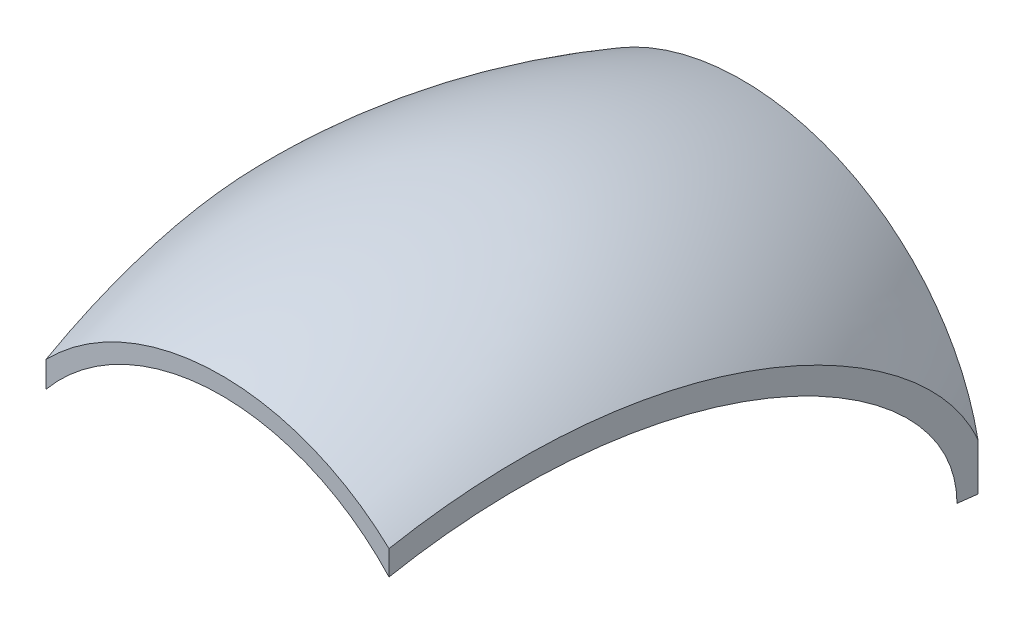
ISO-10303-21;
HEADER;
FILE_DESCRIPTION(('STEP AP214'),'2;1');
FILE_NAME('part.step','',(''),(''),'','','');
FILE_SCHEMA(('AUTOMOTIVE_DESIGN { 1 0 10303 214 1 1 1 1 }'));
ENDSEC;
DATA;
#1=APPLICATION_CONTEXT('core data for automotive mechanical design processes');
#2=APPLICATION_PROTOCOL_DEFINITION('international standard','automotive_design',2000,#1);
#3=PRODUCT_CONTEXT('',#1,'mechanical');
#4=PRODUCT('Part','Part','',(#3));
#5=PRODUCT_RELATED_PRODUCT_CATEGORY('part','',(#4));
#6=PRODUCT_DEFINITION_FORMATION('','',#4);
#7=PRODUCT_DEFINITION_CONTEXT('part definition',#1,'design');
#8=PRODUCT_DEFINITION('design','',#6,#7);
#9=PRODUCT_DEFINITION_SHAPE('','',#8);
#10=(LENGTH_UNIT() NAMED_UNIT(*) SI_UNIT(.MILLI.,.METRE.));
#11=(NAMED_UNIT(*) PLANE_ANGLE_UNIT() SI_UNIT($,.RADIAN.));
#12=(NAMED_UNIT(*) SI_UNIT($,.STERADIAN.) SOLID_ANGLE_UNIT());
#13=UNCERTAINTY_MEASURE_WITH_UNIT(LENGTH_MEASURE(1.E-05),#10,'distance_accuracy_value','');
#14=(GEOMETRIC_REPRESENTATION_CONTEXT(3) GLOBAL_UNCERTAINTY_ASSIGNED_CONTEXT((#13)) GLOBAL_UNIT_ASSIGNED_CONTEXT((#10,
#11,#12)) REPRESENTATION_CONTEXT('',''));
#15=CARTESIAN_POINT('',(0.,0.,0.));
#16=DIRECTION('',(0.,0.,1.));
#17=DIRECTION('',(1.,0.,0.));
#18=AXIS2_PLACEMENT_3D('',#15,#16,#17);
#19=CARTESIAN_POINT('',(0.,0.,120.));
#20=DIRECTION('',(0.,0.,1.));
#21=DIRECTION('',(1.,0.,0.));
#22=AXIS2_PLACEMENT_3D('',#19,#20,#21);
#23=PLANE('',#22);
#24=CARTESIAN_POINT('',(0.,0.,120.));
#25=DIRECTION('',(0.,0.,1.));
#26=DIRECTION('',(1.,0.,0.));
#27=AXIS2_PLACEMENT_3D('',#24,#25,#26);
#28=CIRCLE('',#27,52.5);
#29=CARTESIAN_POINT('',(38.6400456419407,35.5415137947988,120.));
#30=VERTEX_POINT('',#29);
#31=CARTESIAN_POINT('',(-40.449298230202,33.4678890074766,120.));
#32=VERTEX_POINT('',#31);
#33=EDGE_CURVE('E348',#30,#32,#28,.T.);
#34=ORIENTED_EDGE('',*,*,#33,.F.);
#35=DIRECTION('',(0.,1.,0.));
#36=VECTOR('',#35,1.);
#37=CARTESIAN_POINT('',(38.6400456420249,0.,120.));
#38=LINE('',#37,#36);
#39=CARTESIAN_POINT('',(38.6400456420249,41.2213647106911,120.));
#40=VERTEX_POINT('',#39);
#41=EDGE_CURVE('E162',#30,#40,#38,.T.);
#42=ORIENTED_EDGE('',*,*,#41,.T.);
#43=CARTESIAN_POINT('',(0.,0.,120.));
#44=DIRECTION('',(0.,0.,1.));
#45=DIRECTION('',(1.,0.,0.));
#46=AXIS2_PLACEMENT_3D('',#43,#44,#45);
#47=CIRCLE('',#46,56.5);
#48=CARTESIAN_POINT('',(-40.4492982309235,39.4475696083579,120.));
#49=VERTEX_POINT('',#48);
#50=EDGE_CURVE('E147',#40,#49,#47,.T.);
#51=ORIENTED_EDGE('',*,*,#50,.T.);
#52=DIRECTION('',(0.,1.,0.));
#53=VECTOR('',#52,1.);
#54=CARTESIAN_POINT('',(-40.4492982300881,4.84831124224447E-13,120.));
#55=LINE('',#54,#53);
#56=EDGE_CURVE('E297',#32,#49,#55,.T.);
#57=ORIENTED_EDGE('',*,*,#56,.F.);
#58=EDGE_LOOP('',(#34,#42,#51,#57));
#59=FACE_BOUND('',#58,.T.);
#60=ADVANCED_FACE('F143',(#59),#23,.T.);
#61=CARTESIAN_POINT('',(0.,0.,0.));
#62=DIRECTION('',(0.,0.,1.));
#63=DIRECTION('',(1.,0.,0.));
#64=AXIS2_PLACEMENT_3D('',#61,#62,#63);
#65=PLANE('',#64);
#66=DIRECTION('',(0.,1.,0.));
#67=VECTOR('',#66,1.);
#68=CARTESIAN_POINT('',(54.4383453525087,0.,0.));
#69=LINE('',#68,#67);
#70=CARTESIAN_POINT('',(54.4383453525087,0.,0.));
#71=VERTEX_POINT('',#70);
#72=CARTESIAN_POINT('',(54.4383453501977,10.8038806309582,0.));
#73=VERTEX_POINT('',#72);
#74=EDGE_CURVE('E213',#71,#73,#69,.T.);
#75=ORIENTED_EDGE('',*,*,#74,.F.);
#76=DIRECTION('',(1.,0.,0.));
#77=VECTOR('',#76,1.);
#78=CARTESIAN_POINT('',(0.,0.,0.));
#79=LINE('',#78,#77);
#80=CARTESIAN_POINT('',(52.5,0.,0.));
#81=VERTEX_POINT('',#80);
#82=EDGE_CURVE('E210',#81,#71,#79,.T.);
#83=ORIENTED_EDGE('',*,*,#82,.F.);
#84=CARTESIAN_POINT('',(0.,0.,0.));
#85=DIRECTION('',(0.,0.,1.));
#86=DIRECTION('',(1.,0.,0.));
#87=AXIS2_PLACEMENT_3D('',#84,#85,#86);
#88=CIRCLE('',#87,52.5);
#89=CARTESIAN_POINT('',(-52.5,0.,0.));
#90=VERTEX_POINT('',#89);
#91=EDGE_CURVE('E217',#81,#90,#88,.T.);
#92=ORIENTED_EDGE('',*,*,#91,.T.);
#93=DIRECTION('',(-1.,0.,0.));
#94=VECTOR('',#93,1.);
#95=CARTESIAN_POINT('',(0.,0.,0.));
#96=LINE('',#95,#94);
#97=CARTESIAN_POINT('',(-55.5,0.,0.));
#98=VERTEX_POINT('',#97);
#99=EDGE_CURVE('E227',#90,#98,#96,.T.);
#100=ORIENTED_EDGE('',*,*,#99,.T.);
#101=CARTESIAN_POINT('',(0.,0.,0.));
#102=DIRECTION('',(0.,0.,1.));
#103=DIRECTION('',(1.,0.,0.));
#104=AXIS2_PLACEMENT_3D('',#101,#102,#103);
#105=CIRCLE('',#104,55.5);
#106=EDGE_CURVE('E337',#73,#98,#105,.T.);
#107=ORIENTED_EDGE('',*,*,#106,.F.);
#108=EDGE_LOOP('',(#75,#83,#92,#100,#107));
#109=FACE_BOUND('',#108,.T.);
#110=ADVANCED_FACE('F263',(#109),#65,.F.);
#111=CARTESIAN_POINT('',(52.5,0.,0.));
#112=DIRECTION('',(0.,-1.,0.));
#113=DIRECTION('',(1.,0.,0.));
#114=AXIS2_PLACEMENT_3D('',#111,#112,#113);
#115=PLANE('',#114);
#116=ORIENTED_EDGE('',*,*,#82,.T.);
#117=DIRECTION('',(-0.130526192220021,0.,0.991444861373815));
#118=VECTOR('',#117,1.);
#119=CARTESIAN_POINT('',(54.4053215943821,0.,0.250840346607543));
#120=LINE('',#119,#118);
#121=CARTESIAN_POINT('',(53.8751724265603,0.,4.27772303350647));
#122=VERTEX_POINT('',#121);
#123=EDGE_CURVE('E199',#71,#122,#120,.T.);
#124=ORIENTED_EDGE('',*,*,#123,.T.);
#125=CARTESIAN_POINT('',(52.5,0.,0.));
#126=CARTESIAN_POINT('',(59.1666666666667,0.,20.));
#127=CARTESIAN_POINT('',(65.8333366362036,0.,59.9436905243839));
#128=CARTESIAN_POINT('',(59.1666666666667,0.,100.));
#129=CARTESIAN_POINT('',(52.5,0.,120.));
#130=B_SPLINE_CURVE_WITH_KNOTS('',3,(#125,#126,#127,#128,#129),.UNSPECIFIED.,.F.,.F.,(4,1,4),
(0.,0.500351934048242,1.),.UNSPECIFIED.);
#131=EDGE_CURVE('E207',#122,#81,#130,.F.);
#132=ORIENTED_EDGE('',*,*,#131,.T.);
#133=EDGE_LOOP('',(#116,#124,#132));
#134=FACE_BOUND('',#133,.T.);
#135=ADVANCED_FACE('F206',(#134),#115,.T.);
#136=CARTESIAN_POINT('',(55.5,0.,0.));
#137=CARTESIAN_POINT('',(62.6664236279888,0.,19.9708353586557));
#138=CARTESIAN_POINT('',(69.9997772613024,0.,59.9728551946264));
#139=CARTESIAN_POINT('',(63.3330902946555,0.,99.9708353586556));
#140=CARTESIAN_POINT('',(56.5,0.,120.));
#141=CARTESIAN_POINT('',(55.5,3.63246647672641,0.));
#142=CARTESIAN_POINT('',(62.6397588036467,4.10150944467225,19.970835289697));
#143=CARTESIAN_POINT('',(70.0258211541007,4.58147303289983,59.9728552635852));
#144=CARTESIAN_POINT('',(63.307665639183,4.14514266913435,99.9708352896969));
#145=CARTESIAN_POINT('',(56.5,3.69791632315391,120.));
#146=CARTESIAN_POINT('',(54.7846812157303,10.8973230179151,0.));
#147=CARTESIAN_POINT('',(61.8711103706928,12.3044519217526,19.9708351517797));
#148=CARTESIAN_POINT('',(69.085480719058,13.7443597520753,59.9728554015021));
#149=CARTESIAN_POINT('',(62.5286093310337,12.4353516625805,99.9708351517798));
#150=CARTESIAN_POINT('',(55.7717930027957,11.0936726246392,120.));
#151=CARTESIAN_POINT('',(51.6058841645924,21.3759084116572,0.));
#152=CARTESIAN_POINT('',(58.2661839414425,24.1360522183123,19.9708351698329));
#153=CARTESIAN_POINT('',(65.0915722389481,26.9604885494275,59.9728553834499));
#154=CARTESIAN_POINT('',(58.8862305909263,24.3928190563492,99.9708351698327));
#155=CARTESIAN_POINT('',(52.5357228058356,21.7610586699231,120.));
#156=CARTESIAN_POINT('',(46.4441590759705,31.0329783002357,0.));
#157=CARTESIAN_POINT('',(52.4421352204153,35.0400966023841,19.9708352774234));
#158=CARTESIAN_POINT('',(58.5771587704008,39.1405542400829,59.9728552758584));
#159=CARTESIAN_POINT('',(52.9999812340786,35.4128642991492,99.9708352774235));
#160=CARTESIAN_POINT('',(47.2809900818416,31.592129845059,120.));
#161=CARTESIAN_POINT('',(39.4974668844866,39.4974870980994,0.));
#162=CARTESIAN_POINT('',(44.597339905762,44.5975842284013,19.9708352165828));
#163=CARTESIAN_POINT('',(49.8167202528523,49.8164797069009,59.9728553366999));
#164=CARTESIAN_POINT('',(45.0717960141951,45.0720281504694,99.9708352165826));
#165=CARTESIAN_POINT('',(40.2091344386144,40.2091529812886,120.));
#166=CARTESIAN_POINT('',(31.0329881314747,46.4441273213007,0.));
#167=CARTESIAN_POINT('',(35.0401812193317,52.4412106371056,19.9708352469248));
#168=CARTESIAN_POINT('',(39.1405239266854,58.577986111987,59.9728553063569));
#169=CARTESIAN_POINT('',(35.4129470116661,52.9990977373936,99.9708352469249));
#170=CARTESIAN_POINT('',(31.5921412686875,47.2809579717094,120.));
#171=CARTESIAN_POINT('',(21.3758836900515,51.6059511573662,0.));
#172=CARTESIAN_POINT('',(24.1360274251811,58.2695551563672,19.9708352327811));
#173=CARTESIAN_POINT('',(26.9605151609919,65.0883768219473,59.9728553205016));
#174=CARTESIAN_POINT('',(24.3927960397479,58.8894463757879,99.970835232781));
#175=CARTESIAN_POINT('',(21.7610354255786,52.5357879865035,120.));
#176=CARTESIAN_POINT('',(10.8973364377171,54.7845860137513,0.));
#177=CARTESIAN_POINT('',(12.3044579648162,61.8586318081159,19.9708352390401));
#178=CARTESIAN_POINT('',(13.7443433035175,69.097455816647,59.9728553142413));
#179=CARTESIAN_POINT('',(12.435356804715,62.5167048728608,99.9708352390405));
#180=CARTESIAN_POINT('',(11.093684994146,55.7716956108669,120.));
#181=CARTESIAN_POINT('',(0.,55.8578805258364,0.));
#182=CARTESIAN_POINT('',(0.,63.0705154489759,19.970835235938));
#183=CARTESIAN_POINT('',(0.,70.4511568011285,59.9728553173449));
#184=CARTESIAN_POINT('',(0.,63.7414810074847,99.9708352359376));
#185=CARTESIAN_POINT('',(-1.23165366794353E-13,56.8643288636005,120.));
#186=CARTESIAN_POINT('',(-10.897336437717,54.7845860137511,0.));
#187=CARTESIAN_POINT('',(-12.3044579648162,61.8586318081158,19.9708352390401));
#188=CARTESIAN_POINT('',(-13.7443433035176,69.0974558166471,59.9728553142414));
#189=CARTESIAN_POINT('',(-12.435356804715,62.5167048728607,99.9708352390403));
#190=CARTESIAN_POINT('',(-11.0936849941459,55.7716956108667,120.));
#191=CARTESIAN_POINT('',(-21.3758836900514,51.6059511573665,0.));
#192=CARTESIAN_POINT('',(-24.136027425181,58.2695551563673,19.9708352327811));
#193=CARTESIAN_POINT('',(-26.9605151609917,65.0883768219471,59.9728553205017));
#194=CARTESIAN_POINT('',(-24.3927960397479,58.8894463757879,99.9708352327811));
#195=CARTESIAN_POINT('',(-21.7610354255788,52.5357879865037,120.));
#196=CARTESIAN_POINT('',(-31.0329881314746,46.4441273213005,0.));
#197=CARTESIAN_POINT('',(-35.0401812193317,52.4412106371056,19.9708352469247));
#198=CARTESIAN_POINT('',(-39.1405239266854,58.5779861119873,59.9728553063566));
#199=CARTESIAN_POINT('',(-35.4129470116661,52.9990977373937,99.970835246925));
#200=CARTESIAN_POINT('',(-31.5921412686873,47.2809579717092,120.));
#201=CARTESIAN_POINT('',(-39.4974668844867,39.4974870980996,0.));
#202=CARTESIAN_POINT('',(-44.5973399057619,44.5975842284013,19.9708352165829));
#203=CARTESIAN_POINT('',(-49.8167202528522,49.8164797069007,59.9728553366999));
#204=CARTESIAN_POINT('',(-45.0717960141952,45.0720281504694,99.9708352165827));
#205=CARTESIAN_POINT('',(-40.2091344386147,40.2091529812888,120.));
#206=CARTESIAN_POINT('',(-46.4441590759702,31.0329783002356,0.));
#207=CARTESIAN_POINT('',(-52.4421352204151,35.0400966023842,19.9708352774234));
#208=CARTESIAN_POINT('',(-58.5771587704007,39.1405542400832,59.9728552758583));
#209=CARTESIAN_POINT('',(-52.9999812340784,35.4128642991493,99.9708352774234));
#210=CARTESIAN_POINT('',(-47.2809900818413,31.5921298450589,120.));
#211=CARTESIAN_POINT('',(-51.6058841645925,21.3759084116574,0.));
#212=CARTESIAN_POINT('',(-58.2661839414426,24.1360522183123,19.9708351698329));
#213=CARTESIAN_POINT('',(-65.0915722389483,26.9604885494275,59.97285538345));
#214=CARTESIAN_POINT('',(-58.8862305909264,24.3928190563492,99.9708351698327));
#215=CARTESIAN_POINT('',(-52.5357228058357,21.7610586699232,120.));
#216=CARTESIAN_POINT('',(-54.7846812157302,10.8973230179151,0.));
#217=CARTESIAN_POINT('',(-61.8711103706926,12.3044519217526,19.9708351517797));
#218=CARTESIAN_POINT('',(-69.0854807190578,13.7443597520753,59.9728554015021));
#219=CARTESIAN_POINT('',(-62.5286093310336,12.4353516625805,99.9708351517799));
#220=CARTESIAN_POINT('',(-55.7717930027957,11.0936726246393,120.));
#221=CARTESIAN_POINT('',(-55.5,3.63246647672642,0.));
#222=CARTESIAN_POINT('',(-62.6397588036466,4.10150944467226,19.970835289697));
#223=CARTESIAN_POINT('',(-70.0258211541007,4.58147303289985,59.9728552635851));
#224=CARTESIAN_POINT('',(-63.3076656391829,4.14514266913435,99.970835289697));
#225=CARTESIAN_POINT('',(-56.5,3.69791632315392,120.));
#226=CARTESIAN_POINT('',(-55.5,0.,0.));
#227=CARTESIAN_POINT('',(-62.6664236279888,0.,19.9708353586557));
#228=CARTESIAN_POINT('',(-69.9997772613024,0.,59.9728551946264));
#229=CARTESIAN_POINT('',(-63.3330902946555,0.,99.9708353586556));
#230=CARTESIAN_POINT('',(-56.5,0.,120.));
#231=B_SPLINE_SURFACE_WITH_KNOTS('',3,3,((#136,#137,#138,#139,#140),(#141,#142,#143,#144,#145),
(#146,#147,#148,#149,#150),(#151,#152,#153,#154,#155),(#156,#157,#158,#159,#160),(#161,#162,
#163,#164,#165),(#166,#167,#168,#169,#170),(#171,#172,#173,#174,#175),(#176,#177,#178,#179,
#180),(#181,#182,#183,#184,#185),(#186,#187,#188,#189,#190),(#191,#192,#193,#194,#195),(#196,
#197,#198,#199,#200),(#201,#202,#203,#204,#205),(#206,#207,#208,#209,#210),(#211,#212,#213,#214,
#215),(#216,#217,#218,#219,#220),(#221,#222,#223,#224,#225),(#226,#227,#228,#229,#230)),
.UNSPECIFIED.,.F.,.F.,.F.,(4,1,1,1,1,1,1,1,1,1,1,1,1,1,1,1,4),(4,1,4),(0.,0.0625,0.125,0.1875,
0.25,0.3125,0.375,0.4375,0.5,0.5625,0.625,0.6875,0.75,0.8125,0.875,0.9375,1.),(0.,
0.500351934048242,1.),.UNSPECIFIED.);
#232=CARTESIAN_POINT('',(38.640045642417,41.2213806508735,119.99999999995));
#233=CARTESIAN_POINT('',(38.8003305715688,41.640403013143,118.78251508826));
#234=CARTESIAN_POINT('',(38.9613601885351,42.0427023699671,117.559373712148));
#235=CARTESIAN_POINT('',(39.2847969806921,42.8134319330088,115.10262736735));
#236=CARTESIAN_POINT('',(39.4472041762044,43.1818616386431,113.869022244307));
#237=CARTESIAN_POINT('',(39.7734555035237,43.8847954252343,111.390897383191));
#238=CARTESIAN_POINT('',(39.9373009968485,44.2192624668759,110.146367303362));
#239=CARTESIAN_POINT('',(40.2661332476137,44.853278748933,107.648638382174));
#240=CARTESIAN_POINT('',(40.4311200011872,45.1528281075955,106.395439570186));
#241=CARTESIAN_POINT('',(40.9277520004338,45.9984693946262,102.623145019418));
#242=CARTESIAN_POINT('',(41.26097269256,46.4913466832665,100.092082576744));
#243=CARTESIAN_POINT('',(41.9325560598448,47.3325729831324,94.9909004526439));
#244=CARTESIAN_POINT('',(42.2709376085197,47.680034759564,92.4206374126286));
#245=CARTESIAN_POINT('',(42.9496896057401,48.2207337317707,87.2650041382224));
#246=CARTESIAN_POINT('',(43.2900592988589,48.4140260976332,84.6796396418665));
#247=CARTESIAN_POINT('',(43.9715990564975,48.6412561473159,79.5028312247955));
#248=CARTESIAN_POINT('',(44.3127688320087,48.6752444974934,76.9113894993188));
#249=CARTESIAN_POINT('',(45.0576512901969,48.5700166513877,71.2534455040374));
#250=CARTESIAN_POINT('',(45.4612928502339,48.3976966748952,68.1874834643192));
#251=CARTESIAN_POINT('',(46.2657270667413,47.814296264587,62.0771989558645));
#252=CARTESIAN_POINT('',(46.6665195392591,47.4032005533143,59.0328778843873));
#253=CARTESIAN_POINT('',(47.2628591279836,46.6022882323485,54.5032290007514));
#254=CARTESIAN_POINT('',(47.460585484132,46.3050944297033,53.0013482178427));
#255=CARTESIAN_POINT('',(47.8542842867802,45.6482132274168,50.0109089184523));
#256=CARTESIAN_POINT('',(48.0502566664247,45.2885234562305,48.5223509097868));
#257=CARTESIAN_POINT('',(48.43996622849,44.5056123795243,45.56221290096));
#258=CARTESIAN_POINT('',(48.6337040489256,44.082409717399,44.0906280545953));
#259=CARTESIAN_POINT('',(49.018541203554,43.171113982873,41.1674996545967));
#260=CARTESIAN_POINT('',(49.2096408848267,42.6830295380376,39.715953464629));
#261=CARTESIAN_POINT('',(49.5708942474991,41.6894331384036,36.9719617493735));
#262=CARTESIAN_POINT('',(49.741327213458,41.1898799698576,35.6773948472469));
#263=CARTESIAN_POINT('',(50.0792061635306,40.1348926278919,33.1109494226287));
#264=CARTESIAN_POINT('',(50.2466524654553,39.579464442402,31.8390684861239));
#265=CARTESIAN_POINT('',(50.5781216939152,38.4109565074755,29.3213097308068));
#266=CARTESIAN_POINT('',(50.7421440592773,37.7978673968392,28.0754361745285));
#267=CARTESIAN_POINT('',(51.0662253801304,36.5119436366934,25.6137941488007));
#268=CARTESIAN_POINT('',(51.2262830689361,35.8390901999153,24.3980353007808));
#269=CARTESIAN_POINT('',(51.5416779038907,34.4314889651154,22.0023736860419));
#270=CARTESIAN_POINT('',(51.6970155864113,33.6967482359022,20.8224668451745));
#271=CARTESIAN_POINT('',(52.0021210466921,32.1628578506243,18.5049607904308));
#272=CARTESIAN_POINT('',(52.1518909354365,31.3637329768793,17.3673455420386));
#273=CARTESIAN_POINT('',(52.3916496043198,30.0006273316173,15.5461976468062));
#274=CARTESIAN_POINT('',(52.4835881476368,29.456700124038,14.8478550782878));
#275=CARTESIAN_POINT('',(52.6644939945039,28.3406178757604,13.4737387479308));
#276=CARTESIAN_POINT('',(52.7534615658476,27.7684653907752,12.7979629519976));
#277=CARTESIAN_POINT('',(52.9280754642076,26.5949245159156,11.4716387153906));
#278=CARTESIAN_POINT('',(53.0137213440162,25.9935322138053,10.8210936715963));
#279=CARTESIAN_POINT('',(53.1808535399883,24.7635475401075,9.55159860667153));
#280=CARTESIAN_POINT('',(53.2623575522713,24.1350966668111,8.93251417016971));
#281=CARTESIAN_POINT('',(53.4211237753528,22.8475340437526,7.7265649782363));
#282=CARTESIAN_POINT('',(53.4983863501742,22.188424934242,7.1396974577767));
#283=CARTESIAN_POINT('',(53.6480705168234,20.8388511295471,6.00273333334056));
#284=CARTESIAN_POINT('',(53.720493457495,20.1483952618048,5.4526264838785));
#285=CARTESIAN_POINT('',(53.8337025231037,19.0006208499071,4.59271825818356));
#286=CARTESIAN_POINT('',(53.8761672264513,18.5529805985417,4.2701668130853));
#287=CARTESIAN_POINT('',(53.9587587032509,17.6453151801144,3.64282226350806));
#288=CARTESIAN_POINT('',(53.9988859538481,17.1852925688988,3.33802553475205));
#289=CARTESIAN_POINT('',(54.0766021408571,16.2530141794215,2.74771248765297));
#290=CARTESIAN_POINT('',(54.1141918570552,15.7807622215391,2.46219024624529));
#291=CARTESIAN_POINT('',(54.1868853832811,14.8208240737083,1.91002809544602));
#292=CARTESIAN_POINT('',(54.2219704775965,14.3330545475615,1.64353034600511));
#293=CARTESIAN_POINT('',(54.2891581300056,13.3453552224465,1.13318945889405));
#294=CARTESIAN_POINT('',(54.3212596436119,12.8454212416702,0.889354254894068));
#295=CARTESIAN_POINT('',(54.3822698975064,11.8335483243828,0.425935367956095));
#296=CARTESIAN_POINT('',(54.4111748579348,11.3215960252021,0.206380395903886));
#297=CARTESIAN_POINT('',(54.4383453535668,10.8042163025024,-8.03746163822316E-09));
#298=B_SPLINE_CURVE_WITH_KNOTS('',3,(#232,#233,#234,#235,#236,#237,#238,#239,#240,#241,#242,
#243,#244,#245,#246,#247,#248,#249,#250,#251,#252,#253,#254,#255,#256,#257,#258,#259,#260,#261,
#262,#263,#264,#265,#266,#267,#268,#269,#270,#271,#272,#273,#274,#275,#276,#277,#278,#279,#280,
#281,#282,#283,#284,#285,#286,#287,#288,#289,#290,#291,#292,#293,#294,#295,#296,#297),
.UNSPECIFIED.,.F.,.F.,(4,2,2,2,2,2,2,2,2,2,2,2,2,2,2,2,2,2,2,2,2,2,2,2,2,2,2,2,2,2,2,2,4),(0.,
3.89241513043701,7.78488778036964,11.6815609268282,15.5782208770059,23.3738369179441,
31.2163469465213,39.0560492434594,46.8932579678347,56.1760337940928,65.4594036205449,
70.0894720435688,74.7197162029793,79.3486038624106,83.9768766164774,88.1697575581681,
92.362189641211,96.5553035406663,100.749740267114,104.943698550134,109.136050164836,
111.805230534704,114.474169660435,117.143466873544,119.800188073117,122.456680901043,
125.112430228852,126.77218557643,128.431600921587,130.090503983696,131.760728202078,
133.431534944875,135.104296721386),.UNSPECIFIED.);
#299=EDGE_CURVE('E315',#40,#73,#298,.T.);
#300=CARTESIAN_POINT('',(-55.5,0.,0.));
#301=CARTESIAN_POINT('',(-62.6664236279888,0.,19.9708353586557));
#302=CARTESIAN_POINT('',(-69.9997772613024,0.,59.9728551946264));
#303=CARTESIAN_POINT('',(-63.3330902946555,0.,99.9708353586556));
#304=CARTESIAN_POINT('',(-56.5,0.,120.));
#305=B_SPLINE_CURVE_WITH_KNOTS('',3,(#300,#301,#302,#303,#304),.UNSPECIFIED.,.F.,.F.,(4,1,4),
(0.,0.500351934048242,1.),.UNSPECIFIED.);
#306=CARTESIAN_POINT('',(-56.0450732360399,0.,1.53832788423583));
#307=VERTEX_POINT('',#306);
#308=EDGE_CURVE('E220',#98,#307,#305,.T.);
#309=CARTESIAN_POINT('',(-40.4492982331189,39.4476341847094,119.999999999614));
#310=CARTESIAN_POINT('',(-40.5643077770339,39.7565678839289,119.126415769124));
#311=CARTESIAN_POINT('',(-40.6797315223304,40.0563701476863,118.249685375024));
#312=CARTESIAN_POINT('',(-40.9113631783928,40.6376238882177,116.490268266281));
#313=CARTESIAN_POINT('',(-41.027571086767,40.9190754209288,115.607581569804));
#314=CARTESIAN_POINT('',(-41.3773058271385,41.7357749557376,112.951082479657));
#315=CARTESIAN_POINT('',(-41.6119436048677,42.243367707816,111.168831613303));
#316=CARTESIAN_POINT('',(-42.0839914283841,43.1839520113575,107.58327241557));
#317=CARTESIAN_POINT('',(-42.3214039179031,43.6168715235435,105.779945522205));
#318=CARTESIAN_POINT('',(-42.7983751489363,44.4059256042394,102.156989332668));
#319=CARTESIAN_POINT('',(-43.0379338519285,44.7620615480585,100.3373603291));
#320=CARTESIAN_POINT('',(-43.7620790576557,45.7163532592878,94.8369314043654));
#321=CARTESIAN_POINT('',(-44.2494495020081,46.1950149042631,91.1349853473162));
#322=CARTESIAN_POINT('',(-45.2276490480805,46.8182498155069,83.7048221222157));
#323=CARTESIAN_POINT('',(-45.7184763810673,46.9629830184199,79.9766183890258));
#324=CARTESIAN_POINT('',(-46.4701660809016,46.9167880984289,74.2669682600115));
#325=CARTESIAN_POINT('',(-46.7312368760703,46.8511727515923,72.2839386938988));
#326=CARTESIAN_POINT('',(-47.2526224460483,46.6183976220107,68.3236221064246));
#327=CARTESIAN_POINT('',(-47.5129372421424,46.4512407265189,66.3463349233893));
#328=CARTESIAN_POINT('',(-48.0321070755514,46.0129006961902,62.4028485260708));
#329=CARTESIAN_POINT('',(-48.290961919014,45.7417040622589,60.4366507842418));
#330=CARTESIAN_POINT('',(-48.8057873885905,45.0935364934875,56.5261631063714));
#331=CARTESIAN_POINT('',(-49.0617633779901,44.7168165838248,54.5818324321304));
#332=CARTESIAN_POINT('',(-49.5705632598891,43.8546625365309,50.7171136366431));
#333=CARTESIAN_POINT('',(-49.8233874576136,43.3692390136601,48.7967231969812));
#334=CARTESIAN_POINT('',(-50.3248431146084,42.2867689197411,44.9877893280146));
#335=CARTESIAN_POINT('',(-50.5734760008312,41.6897612104247,43.0992350599291));
#336=CARTESIAN_POINT('',(-51.0700640429369,40.3682034607562,39.3272743967754));
#337=CARTESIAN_POINT('',(-51.317923149336,39.6415151996496,37.4445975699686));
#338=CARTESIAN_POINT('',(-51.6845462216378,38.4580983553439,34.6598188607129));
#339=CARTESIAN_POINT('',(-51.8059026973358,38.0480246317291,33.7380249113249));
#340=CARTESIAN_POINT('',(-52.0466960574895,37.1959329860822,31.9090177556204));
#341=CARTESIAN_POINT('',(-52.1661329617505,36.7539153938882,31.0018043988695));
#342=CARTESIAN_POINT('',(-52.4027499693944,35.8374731718615,29.2045197899176));
#343=CARTESIAN_POINT('',(-52.5199318148536,35.3630749602443,28.3144353053348));
#344=CARTESIAN_POINT('',(-52.7518643091056,34.3806032413421,26.5527331082455));
#345=CARTESIAN_POINT('',(-52.8666150387762,33.8725308566487,25.6811147814122));
#346=CARTESIAN_POINT('',(-53.0933493866785,32.821838031007,23.9588964258378));
#347=CARTESIAN_POINT('',(-53.2053337708448,32.279227305149,23.1082905792461));
#348=CARTESIAN_POINT('',(-53.4261982871196,31.1582733191152,21.4306580213968));
#349=CARTESIAN_POINT('',(-53.5350788536425,30.5799350956481,20.6036280104351));
#350=CARTESIAN_POINT('',(-53.7341769848098,29.4706594449931,19.0913275617854));
#351=CARTESIAN_POINT('',(-53.8248562536594,28.9445855990114,18.4025501324821));
#352=CARTESIAN_POINT('',(-54.0033100506016,27.8643408364354,17.0470589704274));
#353=CARTESIAN_POINT('',(-54.091084847178,27.3101725288973,16.3803431983392));
#354=CARTESIAN_POINT('',(-54.2633875792168,26.1727369040624,15.0715740128222));
#355=CARTESIAN_POINT('',(-54.3479150876868,25.5894657830016,14.4295238427223));
#356=CARTESIAN_POINT('',(-54.5132326965866,24.3933847060661,13.1738119350163));
#357=CARTESIAN_POINT('',(-54.594025280943,23.7805949520554,12.560131330114));
#358=CARTESIAN_POINT('',(-54.7514277613526,22.5242835998589,11.3645407921899));
#359=CARTESIAN_POINT('',(-54.8280379902832,21.8807644551178,10.7826283307134));
#360=CARTESIAN_POINT('',(-54.9764899973236,20.5623745910492,9.6550233876942));
#361=CARTESIAN_POINT('',(-55.0483330596127,19.8875123988649,9.10932115184198));
#362=CARTESIAN_POINT('',(-55.1676799736482,18.6949905263373,8.20279133871603));
#363=CARTESIAN_POINT('',(-55.216464942634,18.1848403187558,7.83223270990228));
#364=CARTESIAN_POINT('',(-55.3108875626126,17.1477358271985,7.11502170586606));
#365=CARTESIAN_POINT('',(-55.3565254872511,16.6207830101065,6.76836725209728));
#366=CARTESIAN_POINT('',(-55.4443477885051,15.5501764175898,6.10129064615856));
#367=CARTESIAN_POINT('',(-55.4865319842551,15.0065217695685,5.78086986779816));
#368=CARTESIAN_POINT('',(-55.5669672913859,13.9048661065561,5.16990305285175));
#369=CARTESIAN_POINT('',(-55.6052317310331,13.3469223593088,4.87925577802996));
#370=CARTESIAN_POINT('',(-55.6776448203522,12.2155435451394,4.32922375702013));
#371=CARTESIAN_POINT('',(-55.7117935289712,11.6421087002314,4.06983856308323));
#372=CARTESIAN_POINT('',(-55.7756106490243,10.4808278316182,3.58509941097745));
#373=CARTESIAN_POINT('',(-55.8052797079105,9.89298390478679,3.35974053492223));
#374=CARTESIAN_POINT('',(-55.8552578236922,8.80396488750775,2.98011905642699));
#375=CARTESIAN_POINT('',(-55.8763022757748,8.30476596052756,2.82027057297098));
#376=CARTESIAN_POINT('',(-55.9148948507167,7.29853119584905,2.52713086313562));
#377=CARTESIAN_POINT('',(-55.9324433629591,6.79149623772641,2.39383667909765));
#378=CARTESIAN_POINT('',(-55.963879490653,5.77090690949384,2.1550555828786));
#379=CARTESIAN_POINT('',(-55.9777678806218,5.25735394280519,2.04956278765464));
#380=CARTESIAN_POINT('',(-56.0018616073248,4.22009529683283,1.86655276395956));
#381=CARTESIAN_POINT('',(-56.0120302204002,3.69633947439788,1.78931447937092));
#382=CARTESIAN_POINT('',(-56.0283830461498,2.64498264062133,1.6651024359289));
#383=CARTESIAN_POINT('',(-56.034566029749,2.11738049383951,1.61813801282644));
#384=CARTESIAN_POINT('',(-56.0407967026615,1.32439297621044,1.5708113534267));
#385=CARTESIAN_POINT('',(-56.0423663160072,1.0596640587276,1.55888895640067));
#386=CARTESIAN_POINT('',(-56.0444854979929,0.529963446003126,1.54279217111681));
#387=CARTESIAN_POINT('',(-56.0450350538688,0.264991747765027,1.53861787981294));
#388=CARTESIAN_POINT('',(-56.0450732334754,2.43648188448161E-09,1.53832787690862));
#389=B_SPLINE_CURVE_WITH_KNOTS('',3,(#309,#310,#311,#312,#313,#314,#315,#316,#317,#318,#319,
#320,#321,#322,#323,#324,#325,#326,#327,#328,#329,#330,#331,#332,#333,#334,#335,#336,#337,#338,
#339,#340,#341,#342,#343,#344,#345,#346,#347,#348,#349,#350,#351,#352,#353,#354,#355,#356,#357,
#358,#359,#360,#361,#362,#363,#364,#365,#366,#367,#368,#369,#370,#371,#372,#373,#374,#375,#376,
#377,#378,#379,#380,#381,#382,#383,#384,#385,#386,#387,#388),.UNSPECIFIED.,.F.,.F.,(4,2,2,2,2,2,
2,2,2,2,2,2,2,2,2,2,2,2,2,2,2,2,2,2,2,2,2,2,2,2,2,2,2,2,2,2,2,2,2,4),(0.,2.8010304980083,
5.6020524574659,11.2040980681467,16.8115182570884,22.4188380003511,33.6970591739888,
44.9698774666118,50.9713334422659,56.9726187792657,62.974683042974,68.9625887496825,
74.949910000289,80.9351499024867,87.0301535121008,90.0781540377429,93.1261230955937,
96.1716344787521,99.2170443850965,102.261601419135,105.305730219806,107.919346293545,
110.532720090915,113.146436357939,115.758388590771,118.370132632018,120.981170241332,
122.877803980268,124.774272592185,126.670840455248,128.560729014919,130.450590503581,
132.340178585077,133.913252138994,135.486150383483,137.05871551974,138.646411676066,
140.234597206829,141.029502861518,141.824418462991),.UNSPECIFIED.);
#390=EDGE_CURVE('E169',#49,#307,#389,.T.);
#391=ORIENTED_EDGE('',*,*,#50,.F.);
#392=ORIENTED_EDGE('',*,*,#299,.T.);
#393=ORIENTED_EDGE('',*,*,#106,.T.);
#394=ORIENTED_EDGE('',*,*,#308,.T.);
#395=ORIENTED_EDGE('',*,*,#390,.F.);
#396=EDGE_LOOP('',(#391,#392,#393,#394,#395));
#397=FACE_BOUND('',#396,.T.);
#398=ADVANCED_FACE('F262',(#397),#231,.T.);
#399=CARTESIAN_POINT('',(-52.5,0.,0.));
#400=CARTESIAN_POINT('',(-59.1666666666667,0.,20.));
#401=CARTESIAN_POINT('',(-65.8333366362036,0.,59.943690524384));
#402=CARTESIAN_POINT('',(-59.1666666666667,0.,100.));
#403=CARTESIAN_POINT('',(-52.5,0.,120.));
#404=CARTESIAN_POINT('',(-52.5,3.43611693744391,0.));
#405=CARTESIAN_POINT('',(-59.1418660047392,3.8724516702903,20.));
#406=CARTESIAN_POINT('',(-65.8581373227051,4.30877934931753,59.9436905243841));
#407=CARTESIAN_POINT('',(-59.1418660047392,3.8724516702903,99.9999999999998));
#408=CARTESIAN_POINT('',(-52.5,3.43611693744391,120.));
#409=CARTESIAN_POINT('',(-51.8233469202833,10.3082728488242,0.));
#410=CARTESIAN_POINT('',(-58.4156116011676,11.6172770473634,19.9999999999999));
#411=CARTESIAN_POINT('',(-64.9733494495468,12.9262852684386,59.9436905243837));
#412=CARTESIAN_POINT('',(-58.4156116011676,11.6172770473634,99.9999999999997));
#413=CARTESIAN_POINT('',(-51.8233469202833,10.3082728488242,120.));
#414=CARTESIAN_POINT('',(-48.8163806775737,20.2204643599536,0.));
#415=CARTESIAN_POINT('',(-55.0122099737343,22.7881252019112,20.0000000000001));
#416=CARTESIAN_POINT('',(-61.2172946503332,25.3557864119016,59.9436905243841));
#417=CARTESIAN_POINT('',(-55.0122099737343,22.7881252019111,100.));
#418=CARTESIAN_POINT('',(-48.8163806775737,20.2204643599536,120.));
#419=CARTESIAN_POINT('',(-43.933658040708,29.3555216873321,0.));
#420=CARTESIAN_POINT('',(-49.5133647542045,33.0831999386819,19.9999999999999));
#421=CARTESIAN_POINT('',(-55.0905950872319,36.8108802790811,59.9436905243838));
#422=CARTESIAN_POINT('',(-49.5133647542045,33.0831999386819,99.9999999999996));
#423=CARTESIAN_POINT('',(-43.933658040708,29.3555216873321,120.));
#424=CARTESIAN_POINT('',(-37.3624676550516,37.3624916926245,0.));
#425=CARTESIAN_POINT('',(-42.1066943631909,42.1069284736471,20.));
#426=CARTESIAN_POINT('',(-46.8515876902351,46.8513675402979,59.943690524384));
#427=CARTESIAN_POINT('',(-42.1066943631908,42.106928473647,100.));
#428=CARTESIAN_POINT('',(-37.3624676550516,37.3624916926245,120.));
#429=CARTESIAN_POINT('',(-29.355525922434,43.933634837742,0.));
#430=CARTESIAN_POINT('',(-33.0832754362371,49.512506103792,20.));
#431=CARTESIAN_POINT('',(-36.8108488678267,55.0913801511839,59.9436905243841));
#432=CARTESIAN_POINT('',(-33.0832754362372,49.512506103792,99.9999999999997));
#433=CARTESIAN_POINT('',(-29.355525922434,43.933634837742,120.));
#434=CARTESIAN_POINT('',(-20.220429198007,48.8164413502341,0.));
#435=CARTESIAN_POINT('',(-22.7880913748698,55.015352823047,20.));
#436=CARTESIAN_POINT('',(-25.3558022715788,61.2142673623057,59.9436905243838));
#437=CARTESIAN_POINT('',(-22.7880913748698,55.015352823047,100.));
#438=CARTESIAN_POINT('',(-20.220429198007,48.8164413502341,120.));
#439=CARTESIAN_POINT('',(-10.3082900606903,51.8232569181635,0.));
#440=CARTESIAN_POINT('',(-11.617285113311,58.403987826931,20.));
#441=CARTESIAN_POINT('',(-12.9262689525108,64.984721997332,59.9436905243839));
#442=CARTESIAN_POINT('',(-11.617285113311,58.403987826931,99.9999999999999));
#443=CARTESIAN_POINT('',(-10.3082900606903,51.8232569181635,120.));
#444=CARTESIAN_POINT('',(0.,52.8385357764166,0.));
#445=CARTESIAN_POINT('',(0.,59.5481911280921,20.));
#446=CARTESIAN_POINT('',(1.16374513094988E-13,66.2578498032667,59.9436905243842));
#447=CARTESIAN_POINT('',(0.,59.5481911280922,99.9999999999999));
#448=CARTESIAN_POINT('',(0.,52.8385357764166,120.));
#449=CARTESIAN_POINT('',(10.3082900606902,51.8232569181636,0.));
#450=CARTESIAN_POINT('',(11.617285113311,58.4039878269309,19.9999999999999));
#451=CARTESIAN_POINT('',(12.926268952511,64.9847219973317,59.9436905243836));
#452=CARTESIAN_POINT('',(11.617285113311,58.4039878269309,99.9999999999999));
#453=CARTESIAN_POINT('',(10.3082900606902,51.8232569181636,120.));
#454=CARTESIAN_POINT('',(20.2204291980068,48.816441350234,0.));
#455=CARTESIAN_POINT('',(22.7880913748699,55.0153528230469,20.0000000000001));
#456=CARTESIAN_POINT('',(25.355802271579,61.2142673623056,59.9436905243843));
#457=CARTESIAN_POINT('',(22.7880913748699,55.0153528230469,100.));
#458=CARTESIAN_POINT('',(20.2204291980068,48.816441350234,120.));
#459=CARTESIAN_POINT('',(29.355525922434,43.9336348377421,0.));
#460=CARTESIAN_POINT('',(33.0832754362372,49.512506103792,20.));
#461=CARTESIAN_POINT('',(36.8108488678268,55.091380151184,59.9436905243837));
#462=CARTESIAN_POINT('',(33.0832754362372,49.512506103792,99.9999999999999));
#463=CARTESIAN_POINT('',(29.355525922434,43.9336348377421,120.));
#464=CARTESIAN_POINT('',(37.3624676550516,37.3624916926244,0.));
#465=CARTESIAN_POINT('',(42.1066943631909,42.1069284736467,20.));
#466=CARTESIAN_POINT('',(46.8515876902352,46.8513675402973,59.9436905243839));
#467=CARTESIAN_POINT('',(42.1066943631909,42.1069284736467,100.));
#468=CARTESIAN_POINT('',(37.3624676550516,37.3624916926244,120.));
#469=CARTESIAN_POINT('',(43.9336580407079,29.3555216873323,0.));
#470=CARTESIAN_POINT('',(49.5133647542047,33.083199938682,20.));
#471=CARTESIAN_POINT('',(55.0905950872323,36.8108802790812,59.9436905243838));
#472=CARTESIAN_POINT('',(49.5133647542047,33.083199938682,99.9999999999999));
#473=CARTESIAN_POINT('',(43.9336580407079,29.3555216873323,120.));
#474=CARTESIAN_POINT('',(48.8163806775737,20.2204643599534,0.));
#475=CARTESIAN_POINT('',(55.0122099737342,22.788125201911,20.));
#476=CARTESIAN_POINT('',(61.2172946503327,25.3557864119014,59.9436905243841));
#477=CARTESIAN_POINT('',(55.0122099737342,22.788125201911,100.));
#478=CARTESIAN_POINT('',(48.8163806775737,20.2204643599534,120.));
#479=CARTESIAN_POINT('',(51.8233469202833,10.3082728488243,0.));
#480=CARTESIAN_POINT('',(58.4156116011678,11.6172770473634,20.));
#481=CARTESIAN_POINT('',(64.9733494495473,12.9262852684384,59.9436905243837));
#482=CARTESIAN_POINT('',(58.4156116011677,11.6172770473633,100.));
#483=CARTESIAN_POINT('',(51.8233469202833,10.3082728488243,120.));
#484=CARTESIAN_POINT('',(52.5,3.4361169374439,0.));
#485=CARTESIAN_POINT('',(59.1418660047393,3.87245167029025,20.));
#486=CARTESIAN_POINT('',(65.858137322705,4.30877934931757,59.943690524384));
#487=CARTESIAN_POINT('',(59.1418660047393,3.87245167029025,100.));
#488=CARTESIAN_POINT('',(52.5,3.4361169374439,120.));
#489=CARTESIAN_POINT('',(52.5,0.,0.));
#490=CARTESIAN_POINT('',(59.1666666666667,0.,20.));
#491=CARTESIAN_POINT('',(65.8333366362036,0.,59.943690524384));
#492=CARTESIAN_POINT('',(59.1666666666667,0.,100.));
#493=CARTESIAN_POINT('',(52.5,0.,120.));
#494=B_SPLINE_SURFACE_WITH_KNOTS('',3,3,((#399,#400,#401,#402,#403),(#404,#405,#406,#407,#408),
(#409,#410,#411,#412,#413),(#414,#415,#416,#417,#418),(#419,#420,#421,#422,#423),(#424,#425,
#426,#427,#428),(#429,#430,#431,#432,#433),(#434,#435,#436,#437,#438),(#439,#440,#441,#442,
#443),(#444,#445,#446,#447,#448),(#449,#450,#451,#452,#453),(#454,#455,#456,#457,#458),(#459,
#460,#461,#462,#463),(#464,#465,#466,#467,#468),(#469,#470,#471,#472,#473),(#474,#475,#476,#477,
#478),(#479,#480,#481,#482,#483),(#484,#485,#486,#487,#488),(#489,#490,#491,#492,#493)),
.UNSPECIFIED.,.F.,.F.,.F.,(4,1,1,1,1,1,1,1,1,1,1,1,1,1,1,1,4),(4,1,4),(0.,0.0625,0.125,0.1875,
0.25,0.3125,0.375,0.4375,0.5,0.5625,0.625,0.6875,0.75,0.8125,0.875,0.9375,1.),(0.,
0.500351934048242,1.),.UNSPECIFIED.);
#495=CARTESIAN_POINT('',(53.8751724265603,0.,4.27772303350647));
#496=CARTESIAN_POINT('',(53.87507858077,0.243250230547539,4.2784358851192));
#497=CARTESIAN_POINT('',(53.8745022893811,0.486474393072799,4.28281326215704));
#498=CARTESIAN_POINT('',(53.8723866741366,0.972674020238214,4.29888296240476));
#499=CARTESIAN_POINT('',(53.8708473612623,1.21564948768257,4.31057520220396));
#500=CARTESIAN_POINT('',(53.8647920314868,1.94339080455021,4.35656999456243));
#501=CARTESIAN_POINT('',(53.8588384100016,2.42749900152437,4.40179224124336));
#502=CARTESIAN_POINT('',(53.8431611434053,3.39191449027752,4.52087290478466));
#503=CARTESIAN_POINT('',(53.8334387502683,3.87222299029245,4.59472181195841));
#504=CARTESIAN_POINT('',(53.8104571456344,4.8224072294668,4.76928442952424));
#505=CARTESIAN_POINT('',(53.7972377798479,5.29233961819354,4.86969548169173));
#506=CARTESIAN_POINT('',(53.7673478352392,6.22581275518018,5.09673215147544));
#507=CARTESIAN_POINT('',(53.7506764980315,6.68935207499692,5.2233635296019));
#508=CARTESIAN_POINT('',(53.7140416730624,7.60876231373805,5.50163265200415));
#509=CARTESIAN_POINT('',(53.6940777997956,8.06463232780818,5.65327332448564));
#510=CARTESIAN_POINT('',(53.6463333920891,9.06622499241873,6.01592810568977));
#511=CARTESIAN_POINT('',(53.6177978347189,9.60984070715012,6.23267718294054));
#512=CARTESIAN_POINT('',(53.5564194598263,10.6826607134015,6.69889222646146));
#513=CARTESIAN_POINT('',(53.5235758651966,11.2118623839886,6.9483640954472));
#514=CARTESIAN_POINT('',(53.4539520039987,12.2548111159,7.47720982548556));
#515=CARTESIAN_POINT('',(53.4171716560706,12.7685578575401,7.75658430452764));
#516=CARTESIAN_POINT('',(53.3398843399954,13.7821398422768,8.34363975346742));
#517=CARTESIAN_POINT('',(53.299362542825,14.2819085205935,8.65143336097986));
#518=CARTESIAN_POINT('',(53.2150694362947,15.2650138504305,9.29170307158194));
#519=CARTESIAN_POINT('',(53.1712983260034,15.7483515059538,9.62417766259548));
#520=CARTESIAN_POINT('',(53.0808181152388,16.6986286496052,10.3114430956309));
#521=CARTESIAN_POINT('',(53.0341086879365,17.1655663045277,10.6662364201656));
#522=CARTESIAN_POINT('',(52.9127282261807,18.3249197166137,11.5882125617519));
#523=CARTESIAN_POINT('',(52.8362909855275,19.0065179426966,12.1688110468092));
#524=CARTESIAN_POINT('',(52.6781092495925,20.3328702232375,13.3703206180959));
#525=CARTESIAN_POINT('',(52.5963624072593,20.9776077437808,13.9912495319504));
#526=CARTESIAN_POINT('',(52.4283157133857,22.2313564211782,15.2676908980708));
#527=CARTESIAN_POINT('',(52.3420151876761,22.840362259639,15.92320847116));
#528=CARTESIAN_POINT('',(52.1653790167135,24.0247962187629,17.2648933932057));
#529=CARTESIAN_POINT('',(52.0750380460421,24.6001775725547,17.9511011927311));
#530=CARTESIAN_POINT('',(51.8909678196748,25.7177984713604,19.3492533716907));
#531=CARTESIAN_POINT('',(51.7972393105668,26.2600452489505,20.0611920802275));
#532=CARTESIAN_POINT('',(51.6068018584083,27.3129140205878,21.507708140678));
#533=CARTESIAN_POINT('',(51.5100926521404,27.823533209636,22.2422874919256));
#534=CARTESIAN_POINT('',(51.2510116833316,29.1330846969815,24.2102028262849));
#535=CARTESIAN_POINT('',(51.0864104822684,29.9062417771925,25.4604730762204));
#536=CARTESIAN_POINT('',(50.7513930813757,31.3757220369694,28.0051828768858));
#537=CARTESIAN_POINT('',(50.5809739081745,32.0720051352721,29.2996450126163));
#538=CARTESIAN_POINT('',(50.2353628844139,33.3915794954656,31.9248213677501));
#539=CARTESIAN_POINT('',(50.0601702131115,34.014858106286,33.2555418213145));
#540=CARTESIAN_POINT('',(49.7056742349002,35.1924500117102,35.9482061057582));
#541=CARTESIAN_POINT('',(49.5263667899941,35.7466899242439,37.310181367846));
#542=CARTESIAN_POINT('',(49.1645303444956,36.7883320335294,40.0586020368759));
#543=CARTESIAN_POINT('',(48.9820021185705,37.2757500615762,41.4450415596355));
#544=CARTESIAN_POINT('',(48.614233580667,38.1863945600465,44.2385209439471));
#545=CARTESIAN_POINT('',(48.4289930460933,38.6096157291771,45.645562496279));
#546=CARTESIAN_POINT('',(47.9759404711899,39.5630171628095,49.0868384553837));
#547=CARTESIAN_POINT('',(47.7069541550506,40.060666850606,51.1299923724658));
#548=CARTESIAN_POINT('',(47.1655576450207,40.933961754119,55.2423071401413));
#549=CARTESIAN_POINT('',(46.8931462556076,41.3095630675502,57.3114770716296));
#550=CARTESIAN_POINT('',(46.3459726276069,41.9428740600889,61.4676734068919));
#551=CARTESIAN_POINT('',(46.0712101001322,42.2005690337098,63.5547020049805));
#552=CARTESIAN_POINT('',(45.5198801162634,42.6020462247218,67.7424689974216));
#553=CARTESIAN_POINT('',(45.2433106231412,42.7456630371535,69.84322286226));
#554=CARTESIAN_POINT('',(44.6896225519598,42.9217675437624,74.0489013061039));
#555=CARTESIAN_POINT('',(44.4125040702684,42.9542732645144,76.1538251531234));
#556=CARTESIAN_POINT('',(43.8584309940221,42.9113681329194,80.3624280007733));
#557=CARTESIAN_POINT('',(43.5814763909786,42.8359634702147,82.4661070658792));
#558=CARTESIAN_POINT('',(43.039555726997,42.5853618370798,86.5824031780896));
#559=CARTESIAN_POINT('',(42.7745566203826,42.4143119639036,88.5952712320242));
#560=CARTESIAN_POINT('',(42.2458861321366,41.9779775244617,92.6109222673964));
#561=CARTESIAN_POINT('',(41.9822147474612,41.7126931743174,94.6137052719527));
#562=CARTESIAN_POINT('',(41.4567225110792,41.0900772609804,98.6052150876575));
#563=CARTESIAN_POINT('',(41.1949017518356,40.7327411315319,100.59394119648));
#564=CARTESIAN_POINT('',(40.6750349883406,39.9300768495441,104.542721303367));
#565=CARTESIAN_POINT('',(40.4169762216302,39.485235585986,106.502872241933));
#566=CARTESIAN_POINT('',(40.0320538833828,38.7522125544898,109.426647675756));
#567=CARTESIAN_POINT('',(39.9041086096971,38.4969140890662,110.398488514558));
#568=CARTESIAN_POINT('',(39.6489915943339,37.9644933751051,112.336294633229));
#569=CARTESIAN_POINT('',(39.5218198513839,37.6873711624825,113.302259922765));
#570=CARTESIAN_POINT('',(39.2683447303874,37.111453646366,115.227594615548));
#571=CARTESIAN_POINT('',(39.1420411758954,36.8126628983487,116.186965359032));
#572=CARTESIAN_POINT('',(38.8903437739965,36.1933670589864,118.098796934668));
#573=CARTESIAN_POINT('',(38.7649499306674,35.8728618703727,119.051257735846));
#574=CARTESIAN_POINT('',(38.6400456420248,35.5415058036925,120.));
#575=B_SPLINE_CURVE_WITH_KNOTS('',3,(#495,#496,#497,#498,#499,#500,#501,#502,#503,#504,#505,
#506,#507,#508,#509,#510,#511,#512,#513,#514,#515,#516,#517,#518,#519,#520,#521,#522,#523,#524,
#525,#526,#527,#528,#529,#530,#531,#532,#533,#534,#535,#536,#537,#538,#539,#540,#541,#542,#543,
#544,#545,#546,#547,#548,#549,#550,#551,#552,#553,#554,#555,#556,#557,#558,#559,#560,#561,#562,
#563,#564,#565,#566,#567,#568,#569,#570,#571,#572,#573,#574),.UNSPECIFIED.,.F.,.F.,(4,2,2,2,2,2,
2,2,2,2,2,2,2,2,2,2,2,2,2,2,2,2,2,2,2,2,2,2,2,2,2,2,2,2,2,2,2,2,2,4),(0.,0.72969569007534,
1.45938305965321,2.91717813280704,4.37448934546023,5.81586172967632,7.25755111479206,
8.69940941966771,10.455990141167,12.2128881611532,13.9698224975069,15.7340465702593,
17.4981626471958,19.2624752949231,21.9563316405618,24.651386988555,27.3468424629986,
30.0459618258156,32.7444899078412,35.4432569762182,39.8776649779763,44.3143742210404,
48.7518511749698,53.1940052432734,57.6351050606295,62.0765714187906,68.4325157530249,
74.7907438733025,81.1497647869744,87.5179890694387,93.8851801272291,100.252005983326,
106.362068148395,112.472116300478,118.582467601699,124.659735721718,127.698312117942,
130.736883513743,133.774817938223,136.812765971883),.UNSPECIFIED.);
#576=EDGE_CURVE('E12',#122,#30,#575,.T.);
#577=CARTESIAN_POINT('',(-55.12994334885,0.,8.489429479824));
#578=CARTESIAN_POINT('',(-55.1297831662954,0.236856702698141,8.49064617569565));
#579=CARTESIAN_POINT('',(-55.1291583095992,0.473680606564352,8.49539242867283));
#580=CARTESIAN_POINT('',(-55.1269800979828,0.94707581076693,8.51193758486362));
#581=CARTESIAN_POINT('',(-55.1254267502745,1.18364711305108,8.52373643329633));
#582=CARTESIAN_POINT('',(-55.1193788150808,1.89228720011311,8.569675063828));
#583=CARTESIAN_POINT('',(-55.1134960464614,2.36370364703657,8.6143591268304));
#584=CARTESIAN_POINT('',(-55.0980796533005,3.30285701574271,8.73145825790418));
#585=CARTESIAN_POINT('',(-55.0885469783494,3.7705948623063,8.80386611311874));
#586=CARTESIAN_POINT('',(-55.0660292469875,4.69658061494438,8.97490526390159));
#587=CARTESIAN_POINT('',(-55.0530777350065,5.15487644281824,9.07328176423061));
#588=CARTESIAN_POINT('',(-55.0238012661222,6.0651550974847,9.2956586231163));
#589=CARTESIAN_POINT('',(-55.0074758177805,6.51713699435699,9.41966271451774));
#590=CARTESIAN_POINT('',(-54.9715983439893,7.41351230534448,9.69217918363448));
#591=CARTESIAN_POINT('',(-54.9520462746793,7.85790561621502,9.84069189450314));
#592=CARTESIAN_POINT('',(-54.909939644658,8.73679848269134,10.160523502657));
#593=CARTESIAN_POINT('',(-54.8873938605909,9.17132276928655,10.3317757347106));
#594=CARTESIAN_POINT('',(-54.8394302194868,10.0309316011363,10.6960957588892));
#595=CARTESIAN_POINT('',(-54.8140124577168,10.4560164589488,10.8891628273894));
#596=CARTESIAN_POINT('',(-54.7604834225783,11.296064159907,11.2957562161922));
#597=CARTESIAN_POINT('',(-54.7323722947738,11.7110275485523,11.5092814308267));
#598=CARTESIAN_POINT('',(-54.6735914476197,12.5314363342555,11.9557662923465));
#599=CARTESIAN_POINT('',(-54.6429158166621,12.9368568161384,12.1887708423533));
#600=CARTESIAN_POINT('',(-54.5792596617415,13.7369338070109,12.6722873428914));
#601=CARTESIAN_POINT('',(-54.5462790758014,14.1315900261669,12.9227997641859));
#602=CARTESIAN_POINT('',(-54.4781955699563,14.9100480434564,13.4399453337174));
#603=CARTESIAN_POINT('',(-54.4430923571801,15.2938483329621,13.7065807065319));
#604=CARTESIAN_POINT('',(-54.3453575779596,16.3188056407492,14.448950057752));
#605=CARTESIAN_POINT('',(-54.280851940941,16.9495276530101,14.9389190154299));
#606=CARTESIAN_POINT('',(-54.1468959758849,18.1797086108959,15.9564155879288));
#607=CARTESIAN_POINT('',(-54.0774430645544,18.7791509361192,16.4839628248079));
#608=CARTESIAN_POINT('',(-53.9342602823302,19.9473650644599,17.5715440317583));
#609=CARTESIAN_POINT('',(-53.8605297313418,20.5161319626526,18.1315831676617));
#610=CARTESIAN_POINT('',(-53.7091777358676,21.625177386319,19.281215709754));
#611=CARTESIAN_POINT('',(-53.6315474084879,22.1653845332637,19.8708765882204));
#612=CARTESIAN_POINT('',(-53.4730493183131,23.2168122518564,21.0747891085245));
#613=CARTESIAN_POINT('',(-53.3921822993851,23.7280394192571,21.6890351001305));
#614=CARTESIAN_POINT('',(-53.2275930339284,24.7227691044552,22.9392146901331));
#615=CARTESIAN_POINT('',(-53.1438705497309,25.2062693054302,23.5751500938039));
#616=CARTESIAN_POINT('',(-52.9201468549719,26.4440768923858,25.274500268383));
#617=CARTESIAN_POINT('',(-52.7780472085672,27.1762140095115,26.3538542419782));
#618=CARTESIAN_POINT('',(-52.4883047417496,28.5738524175972,28.5546667759385));
#619=CARTESIAN_POINT('',(-52.3406590434432,29.2393184368079,29.676147196075));
#620=CARTESIAN_POINT('',(-52.0407916629583,30.5070157223578,31.9538660846645));
#621=CARTESIAN_POINT('',(-51.8885691921542,31.1092360095418,33.1101105433237));
#622=CARTESIAN_POINT('',(-51.5801769406089,32.2539972757103,35.4525822563312));
#623=CARTESIAN_POINT('',(-51.4240034447253,32.7964793077878,36.6388377299876));
#624=CARTESIAN_POINT('',(-51.108504818304,33.8236524603173,39.0352877191853));
#625=CARTESIAN_POINT('',(-50.9491804680499,34.3083576848609,40.2454763078848));
#626=CARTESIAN_POINT('',(-50.6278464561424,35.2225078799724,42.6862504503896));
#627=CARTESIAN_POINT('',(-50.4658365718809,35.6519482434356,43.91683769507));
#628=CARTESIAN_POINT('',(-50.1214083907464,36.5024362317644,46.5330294684606));
#629=CARTESIAN_POINT('',(-49.9387267278871,36.9172222550968,47.9206344604435));
#630=CARTESIAN_POINT('',(-49.5710925275438,37.6834066385658,50.7130934496785));
#631=CARTESIAN_POINT('',(-49.3861396601726,38.0347956712871,52.1179499526733));
#632=CARTESIAN_POINT('',(-49.0143614246784,38.6762519181766,54.9418860139497));
#633=CARTESIAN_POINT('',(-48.8275353953447,38.9662966184147,56.3609705946246));
#634=CARTESIAN_POINT('',(-48.4524934153912,39.4866281912895,59.2096972563004));
#635=CARTESIAN_POINT('',(-48.2642775260337,39.716917681839,60.639338871968));
#636=CARTESIAN_POINT('',(-47.6976929874679,40.3209370031245,64.9429757109845));
#637=CARTESIAN_POINT('',(-47.3176865758603,40.6073086858693,67.829410974814));
#638=CARTESIAN_POINT('',(-46.5560588598641,40.9577327129078,73.6145478309568));
#639=CARTESIAN_POINT('',(-46.1744378320827,41.0218217071093,76.5132473222288));
#640=CARTESIAN_POINT('',(-45.5317168175903,40.9503579099107,81.3951981113932));
#641=CARTESIAN_POINT('',(-45.2704840536631,40.8712865162579,83.3794579523716));
#642=CARTESIAN_POINT('',(-44.7488071724081,40.6157035930703,87.3419872686772));
#643=CARTESIAN_POINT('',(-44.4883631122077,40.4391851673261,89.3202563100788));
#644=CARTESIAN_POINT('',(-43.9688389975151,39.991001307688,93.2664337409146));
#645=CARTESIAN_POINT('',(-43.7097591617595,39.7193210605727,95.2343404688779));
#646=CARTESIAN_POINT('',(-43.1940393948315,39.083404980685,99.1516210095357));
#647=CARTESIAN_POINT('',(-42.9373958097571,38.719343002432,101.10102257637));
#648=CARTESIAN_POINT('',(-42.426647901964,37.9000419285135,104.980538097551));
#649=CARTESIAN_POINT('',(-42.1725431734146,37.4448176579057,106.910655134487));
#650=CARTESIAN_POINT('',(-41.6674833196401,36.4443233554105,110.74696559598));
#651=CARTESIAN_POINT('',(-41.4165268059233,35.8990946375006,112.65316956718));
#652=CARTESIAN_POINT('',(-41.0467735103542,35.0230994557767,115.461724682652));
#653=CARTESIAN_POINT('',(-40.9265716734647,34.7267604034486,116.374748279539));
#654=CARTESIAN_POINT('',(-40.6871812670751,34.1130926324095,118.193098943492));
#655=CARTESIAN_POINT('',(-40.5679920268317,33.7957792692449,119.098431105361));
#656=CARTESIAN_POINT('',(-40.4492982301355,33.467814609615,120.));
#657=B_SPLINE_CURVE_WITH_KNOTS('',3,(#577,#578,#579,#580,#581,#582,#583,#584,#585,#586,#587,
#588,#589,#590,#591,#592,#593,#594,#595,#596,#597,#598,#599,#600,#601,#602,#603,#604,#605,#606,
#607,#608,#609,#610,#611,#612,#613,#614,#615,#616,#617,#618,#619,#620,#621,#622,#623,#624,#625,
#626,#627,#628,#629,#630,#631,#632,#633,#634,#635,#636,#637,#638,#639,#640,#641,#642,#643,#644,
#645,#646,#647,#648,#649,#650,#651,#652,#653,#654,#655,#656),.UNSPECIFIED.,.F.,.F.,(4,2,2,2,2,2,
2,2,2,2,2,2,2,2,2,2,2,2,2,2,2,2,2,2,2,2,2,2,2,2,2,2,2,2,2,2,2,2,2,4),(0.,0.710524221244623,
1.42104292357761,2.84081793579276,4.26022381802168,5.66618969303944,7.07236050171518,
8.4785504264871,9.8807052879925,11.2828136519565,12.6848462811466,14.090204990133,
15.4956015018888,16.9011923688207,19.3032090359659,21.7064892784542,24.1101526670836,
26.5195640818892,28.9284249021074,31.3374867106064,35.2704817940389,39.2055467263278,
43.1412936417494,47.0808900105849,51.0195226931394,54.9584835038119,59.3361428287168,
63.714445701638,68.094352673971,72.4740677274488,81.2405189672544,90.0055247282902,
96.0121143334857,102.019129072316,108.02707929989,114.023805862423,120.019558011899,
126.01256559623,128.914566937104,131.814466728508),.UNSPECIFIED.);
#658=CARTESIAN_POINT('',(-55.1299433465083,0.,8.48942947951565));
#659=VERTEX_POINT('',#658);
#660=EDGE_CURVE('E312',#659,#32,#657,.T.);
#661=CARTESIAN_POINT('',(-52.5,0.,0.));
#662=CARTESIAN_POINT('',(-59.1666666666667,0.,20.));
#663=CARTESIAN_POINT('',(-65.8333366362036,0.,59.9436905243839));
#664=CARTESIAN_POINT('',(-59.1666666666667,0.,100.));
#665=CARTESIAN_POINT('',(-52.5,0.,120.));
#666=B_SPLINE_CURVE_WITH_KNOTS('',3,(#661,#662,#663,#664,#665),.UNSPECIFIED.,.F.,.F.,(4,1,4),
(0.,0.500351934048242,1.),.UNSPECIFIED.);
#667=EDGE_CURVE('E225',#90,#659,#666,.T.);
#668=ORIENTED_EDGE('',*,*,#131,.F.);
#669=ORIENTED_EDGE('',*,*,#576,.T.);
#670=ORIENTED_EDGE('',*,*,#33,.T.);
#671=ORIENTED_EDGE('',*,*,#660,.F.);
#672=ORIENTED_EDGE('',*,*,#667,.F.);
#673=ORIENTED_EDGE('',*,*,#91,.F.);
#674=EDGE_LOOP('',(#668,#669,#670,#671,#672,#673));
#675=FACE_BOUND('',#674,.T.);
#676=ADVANCED_FACE('F215',(#675),#494,.T.);
#677=CARTESIAN_POINT('',(-55.5,0.,0.));
#678=DIRECTION('',(0.,-1.,0.));
#679=DIRECTION('',(1.,0.,0.));
#680=AXIS2_PLACEMENT_3D('',#677,#678,#679);
#681=PLANE('',#680);
#682=DIRECTION('',(0.130526192220077,0.,0.991444861373807));
#683=VECTOR('',#682,1.);
#684=CARTESIAN_POINT('',(-56.2348610495322,0.,0.0967462925506276));
#685=LINE('',#684,#683);
#686=EDGE_CURVE('E154',#307,#659,#685,.T.);
#687=ORIENTED_EDGE('',*,*,#686,.F.);
#688=ORIENTED_EDGE('',*,*,#308,.F.);
#689=ORIENTED_EDGE('',*,*,#99,.F.);
#690=ORIENTED_EDGE('',*,*,#667,.T.);
#691=EDGE_LOOP('',(#687,#688,#689,#690));
#692=FACE_BOUND('',#691,.T.);
#693=ADVANCED_FACE('F303',(#692),#681,.T.);
#694=CARTESIAN_POINT('',(-48.8023731832681,13.9162633834349,56.5520965704931));
#695=DIRECTION('',(0.991444861373807,0.,-0.130526192220077));
#696=DIRECTION('',(0.130526192220077,0.,0.991444861373807));
#697=AXIS2_PLACEMENT_3D('',#694,#695,#696);
#698=PLANE('',#697);
#699=ORIENTED_EDGE('',*,*,#56,.T.);
#700=ORIENTED_EDGE('',*,*,#390,.T.);
#701=ORIENTED_EDGE('',*,*,#686,.T.);
#702=ORIENTED_EDGE('',*,*,#660,.T.);
#703=EDGE_LOOP('',(#699,#700,#701,#702));
#704=FACE_BOUND('',#703,.T.);
#705=ADVANCED_FACE('F299',(#704),#698,.F.);
#706=CARTESIAN_POINT('',(46.6709128596021,13.9162633834339,58.9995073033239));
#707=DIRECTION('',(0.991444861373814,0.,0.130526192220021));
#708=DIRECTION('',(-0.130526192220021,0.,0.991444861373814));
#709=AXIS2_PLACEMENT_3D('',#706,#707,#708);
#710=PLANE('',#709);
#711=ORIENTED_EDGE('',*,*,#41,.F.);
#712=ORIENTED_EDGE('',*,*,#576,.F.);
#713=ORIENTED_EDGE('',*,*,#123,.F.);
#714=ORIENTED_EDGE('',*,*,#74,.T.);
#715=ORIENTED_EDGE('',*,*,#299,.F.);
#716=EDGE_LOOP('',(#711,#712,#713,#714,#715));
#717=FACE_BOUND('',#716,.T.);
#718=ADVANCED_FACE('F198',(#717),#710,.T.);
#719=CLOSED_SHELL('',(#60,#110,#135,#398,#676,#693,#705,#718));
#720=MANIFOLD_SOLID_BREP('B2',#719);
#721=ADVANCED_BREP_SHAPE_REPRESENTATION('',(#18,#720),#14);
#722=SHAPE_DEFINITION_REPRESENTATION(#9,#721);
ENDSEC;
END-ISO-10303-21;
